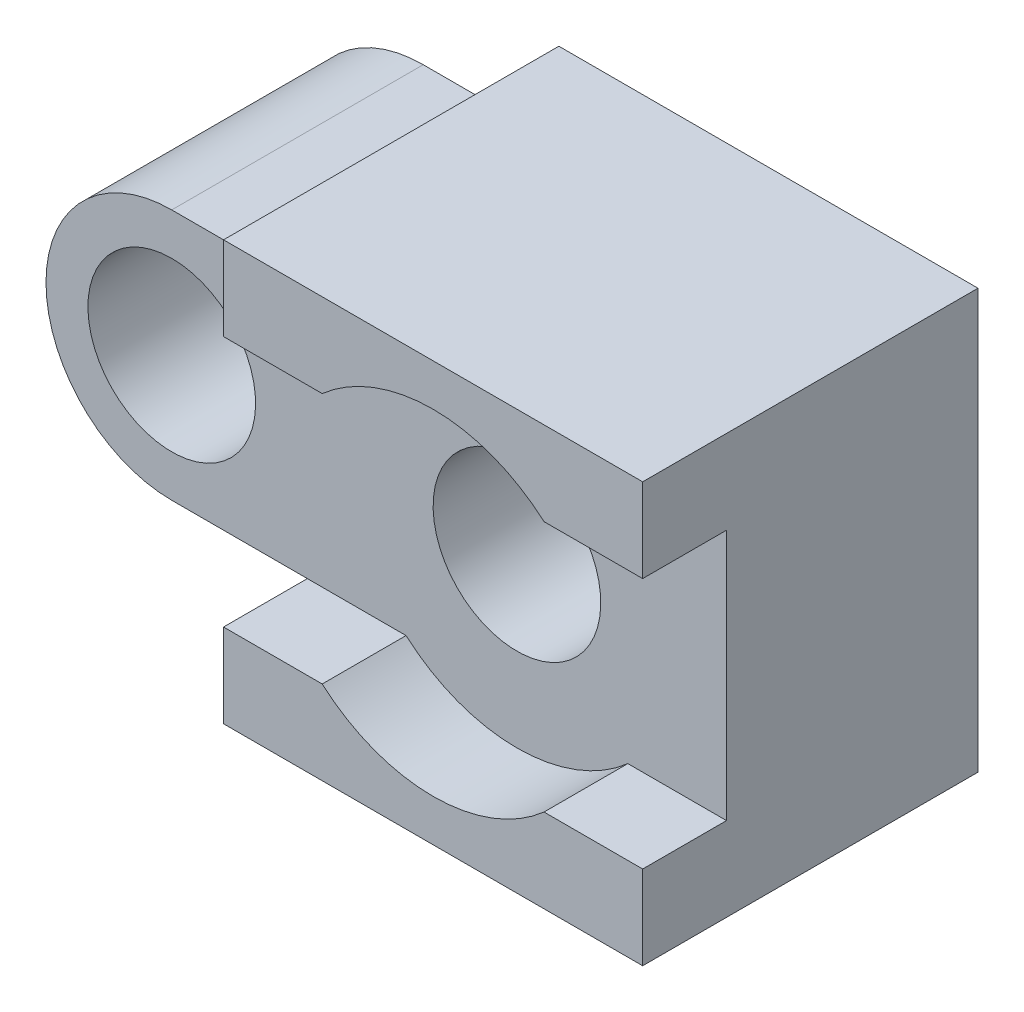
ISO-10303-21;
HEADER;
FILE_DESCRIPTION(('STEP AP214'),'2;1');
FILE_NAME('part.step','',(''),(''),'','','');
FILE_SCHEMA(('AUTOMOTIVE_DESIGN { 1 0 10303 214 1 1 1 1 }'));
ENDSEC;
DATA;
#1=APPLICATION_CONTEXT('core data for automotive mechanical design processes');
#2=APPLICATION_PROTOCOL_DEFINITION('international standard','automotive_design',2000,#1);
#3=PRODUCT_CONTEXT('',#1,'mechanical');
#4=PRODUCT('Part','Part','',(#3));
#5=PRODUCT_RELATED_PRODUCT_CATEGORY('part','',(#4));
#6=PRODUCT_DEFINITION_FORMATION('','',#4);
#7=PRODUCT_DEFINITION_CONTEXT('part definition',#1,'design');
#8=PRODUCT_DEFINITION('design','',#6,#7);
#9=PRODUCT_DEFINITION_SHAPE('','',#8);
#10=(LENGTH_UNIT() NAMED_UNIT(*) SI_UNIT(.MILLI.,.METRE.));
#11=(NAMED_UNIT(*) PLANE_ANGLE_UNIT() SI_UNIT($,.RADIAN.));
#12=(NAMED_UNIT(*) SI_UNIT($,.STERADIAN.) SOLID_ANGLE_UNIT());
#13=UNCERTAINTY_MEASURE_WITH_UNIT(LENGTH_MEASURE(1.E-05),#10,'distance_accuracy_value','');
#14=(GEOMETRIC_REPRESENTATION_CONTEXT(3) GLOBAL_UNCERTAINTY_ASSIGNED_CONTEXT((#13)) GLOBAL_UNIT_ASSIGNED_CONTEXT((#10,
#11,#12)) REPRESENTATION_CONTEXT('',''));
#15=CARTESIAN_POINT('',(0.,0.,0.));
#16=DIRECTION('',(0.,0.,1.));
#17=DIRECTION('',(1.,0.,0.));
#18=AXIS2_PLACEMENT_3D('',#15,#16,#17);
#19=CARTESIAN_POINT('',(-18.,3.,8.));
#20=DIRECTION('',(0.,1.,0.));
#21=DIRECTION('',(0.,0.,1.));
#22=AXIS2_PLACEMENT_3D('',#19,#20,#21);
#23=PLANE('',#22);
#24=DIRECTION('',(0.,0.,-1.));
#25=VECTOR('',#24,1.);
#26=CARTESIAN_POINT('',(2.64575131106459,3.,42.));
#27=LINE('',#26,#25);
#28=CARTESIAN_POINT('',(2.64575131106459,3.,6.));
#29=VERTEX_POINT('',#28);
#30=CARTESIAN_POINT('',(2.64575131106459,3.,8.));
#31=VERTEX_POINT('',#30);
#32=EDGE_CURVE('E141',#29,#31,#27,.F.);
#33=ORIENTED_EDGE('',*,*,#32,.F.);
#34=DIRECTION('',(1.,0.,0.));
#35=VECTOR('',#34,1.);
#36=CARTESIAN_POINT('',(-18.,3.,6.));
#37=LINE('',#36,#35);
#38=CARTESIAN_POINT('',(5.,3.,6.));
#39=VERTEX_POINT('',#38);
#40=EDGE_CURVE('E151',#29,#39,#37,.T.);
#41=ORIENTED_EDGE('',*,*,#40,.T.);
#42=DIRECTION('',(0.,0.,-1.));
#43=VECTOR('',#42,1.);
#44=CARTESIAN_POINT('',(5.,3.,8.));
#45=LINE('',#44,#43);
#46=CARTESIAN_POINT('',(5.,3.,8.));
#47=VERTEX_POINT('',#46);
#48=EDGE_CURVE('E208',#47,#39,#45,.T.);
#49=ORIENTED_EDGE('',*,*,#48,.F.);
#50=DIRECTION('',(1.,0.,0.));
#51=VECTOR('',#50,1.);
#52=CARTESIAN_POINT('',(-18.,3.,8.));
#53=LINE('',#52,#51);
#54=EDGE_CURVE('E153',#31,#47,#53,.T.);
#55=ORIENTED_EDGE('',*,*,#54,.F.);
#56=EDGE_LOOP('',(#33,#41,#49,#55));
#57=FACE_BOUND('',#56,.T.);
#58=ADVANCED_FACE('F33',(#57),#23,.F.);
#59=DIRECTION('',(0.,0.,-1.));
#60=VECTOR('',#59,1.);
#61=CARTESIAN_POINT('',(-2.64575131106459,3.,42.));
#62=LINE('',#61,#60);
#63=CARTESIAN_POINT('',(-2.64575131106459,3.,8.));
#64=VERTEX_POINT('',#63);
#65=CARTESIAN_POINT('',(-2.64575131106459,3.,6.));
#66=VERTEX_POINT('',#65);
#67=EDGE_CURVE('E144',#64,#66,#62,.T.);
#68=ORIENTED_EDGE('',*,*,#67,.F.);
#69=CARTESIAN_POINT('',(-5.,3.,8.));
#70=VERTEX_POINT('',#69);
#71=EDGE_CURVE('E174',#70,#64,#53,.T.);
#72=ORIENTED_EDGE('',*,*,#71,.F.);
#73=DIRECTION('',(0.,0.,-1.));
#74=VECTOR('',#73,1.);
#75=CARTESIAN_POINT('',(-5.,3.,8.));
#76=LINE('',#75,#74);
#77=CARTESIAN_POINT('',(-5.,3.,6.));
#78=VERTEX_POINT('',#77);
#79=EDGE_CURVE('E265',#70,#78,#76,.T.);
#80=ORIENTED_EDGE('',*,*,#79,.T.);
#81=EDGE_CURVE('E162',#78,#66,#37,.T.);
#82=ORIENTED_EDGE('',*,*,#81,.T.);
#83=EDGE_LOOP('',(#68,#72,#80,#82));
#84=FACE_BOUND('',#83,.T.);
#85=ADVANCED_FACE('F285',(#84),#23,.F.);
#86=CARTESIAN_POINT('',(-18.,-3.,8.));
#87=DIRECTION('',(0.,-1.,0.));
#88=DIRECTION('',(0.,0.,-1.));
#89=AXIS2_PLACEMENT_3D('',#86,#87,#88);
#90=PLANE('',#89);
#91=DIRECTION('',(0.,0.,-1.));
#92=VECTOR('',#91,1.);
#93=CARTESIAN_POINT('',(-2.64575131106459,-3.,42.));
#94=LINE('',#93,#92);
#95=CARTESIAN_POINT('',(-2.64575131106459,-3.,6.));
#96=VERTEX_POINT('',#95);
#97=CARTESIAN_POINT('',(-2.64575131106459,-3.,8.));
#98=VERTEX_POINT('',#97);
#99=EDGE_CURVE('E180',#96,#98,#94,.F.);
#100=ORIENTED_EDGE('',*,*,#99,.F.);
#101=DIRECTION('',(1.,0.,0.));
#102=VECTOR('',#101,1.);
#103=CARTESIAN_POINT('',(-18.,-3.,6.));
#104=LINE('',#103,#102);
#105=CARTESIAN_POINT('',(-5.,-3.,6.));
#106=VERTEX_POINT('',#105);
#107=EDGE_CURVE('E166',#106,#96,#104,.T.);
#108=ORIENTED_EDGE('',*,*,#107,.F.);
#109=DIRECTION('',(0.,0.,-1.));
#110=VECTOR('',#109,1.);
#111=CARTESIAN_POINT('',(-5.,-3.,8.));
#112=LINE('',#111,#110);
#113=CARTESIAN_POINT('',(-5.,-3.,8.));
#114=VERTEX_POINT('',#113);
#115=EDGE_CURVE('E257',#114,#106,#112,.T.);
#116=ORIENTED_EDGE('',*,*,#115,.F.);
#117=DIRECTION('',(1.,0.,0.));
#118=VECTOR('',#117,1.);
#119=CARTESIAN_POINT('',(-18.,-3.,8.));
#120=LINE('',#119,#118);
#121=EDGE_CURVE('E196',#114,#98,#120,.T.);
#122=ORIENTED_EDGE('',*,*,#121,.T.);
#123=EDGE_LOOP('',(#100,#108,#116,#122));
#124=FACE_BOUND('',#123,.T.);
#125=ADVANCED_FACE('F296',(#124),#90,.F.);
#126=DIRECTION('',(0.,0.,-1.));
#127=VECTOR('',#126,1.);
#128=CARTESIAN_POINT('',(2.64575131106459,-3.,42.));
#129=LINE('',#128,#127);
#130=CARTESIAN_POINT('',(2.64575131106459,-3.,8.));
#131=VERTEX_POINT('',#130);
#132=CARTESIAN_POINT('',(2.64575131106459,-3.,6.));
#133=VERTEX_POINT('',#132);
#134=EDGE_CURVE('E146',#131,#133,#129,.T.);
#135=ORIENTED_EDGE('',*,*,#134,.F.);
#136=CARTESIAN_POINT('',(5.,-3.,8.));
#137=VERTEX_POINT('',#136);
#138=EDGE_CURVE('E154',#131,#137,#120,.T.);
#139=ORIENTED_EDGE('',*,*,#138,.T.);
#140=DIRECTION('',(0.,0.,1.));
#141=VECTOR('',#140,1.);
#142=CARTESIAN_POINT('',(5.,-3.,8.));
#143=LINE('',#142,#141);
#144=CARTESIAN_POINT('',(5.,-3.,6.));
#145=VERTEX_POINT('',#144);
#146=EDGE_CURVE('E195',#145,#137,#143,.T.);
#147=ORIENTED_EDGE('',*,*,#146,.F.);
#148=EDGE_CURVE('E168',#133,#145,#104,.T.);
#149=ORIENTED_EDGE('',*,*,#148,.F.);
#150=EDGE_LOOP('',(#135,#139,#147,#149));
#151=FACE_BOUND('',#150,.T.);
#152=ADVANCED_FACE('F193',(#151),#90,.F.);
#153=CARTESIAN_POINT('',(-8.23564422329581,0.,8.));
#154=DIRECTION('',(0.,0.,1.));
#155=DIRECTION('',(1.,0.,0.));
#156=AXIS2_PLACEMENT_3D('',#153,#154,#155);
#157=PLANE('',#156);
#158=ORIENTED_EDGE('',*,*,#71,.T.);
#159=CARTESIAN_POINT('',(0.,0.,8.));
#160=DIRECTION('',(0.,0.,1.));
#161=DIRECTION('',(1.,0.,0.));
#162=AXIS2_PLACEMENT_3D('',#159,#160,#161);
#163=CIRCLE('',#162,4.);
#164=EDGE_CURVE('E155',#64,#31,#163,.F.);
#165=ORIENTED_EDGE('',*,*,#164,.T.);
#166=ORIENTED_EDGE('',*,*,#54,.T.);
#167=DIRECTION('',(0.,1.,0.));
#168=VECTOR('',#167,1.);
#169=CARTESIAN_POINT('',(5.,-5.,8.));
#170=LINE('',#169,#168);
#171=CARTESIAN_POINT('',(5.,5.,8.));
#172=VERTEX_POINT('',#171);
#173=EDGE_CURVE('E221',#47,#172,#170,.T.);
#174=ORIENTED_EDGE('',*,*,#173,.T.);
#175=DIRECTION('',(-1.,0.,0.));
#176=VECTOR('',#175,1.);
#177=CARTESIAN_POINT('',(-5.,5.,8.));
#178=LINE('',#177,#176);
#179=CARTESIAN_POINT('',(-5.,5.,8.));
#180=VERTEX_POINT('',#179);
#181=EDGE_CURVE('E220',#172,#180,#178,.T.);
#182=ORIENTED_EDGE('',*,*,#181,.T.);
#183=DIRECTION('',(0.,-1.,0.));
#184=VECTOR('',#183,1.);
#185=CARTESIAN_POINT('',(-5.,3.,8.));
#186=LINE('',#185,#184);
#187=EDGE_CURVE('E223',#180,#70,#186,.T.);
#188=ORIENTED_EDGE('',*,*,#187,.T.);
#189=EDGE_LOOP('',(#158,#165,#166,#174,#182,#188));
#190=FACE_BOUND('',#189,.T.);
#191=ADVANCED_FACE('F305',(#190),#157,.T.);
#192=ORIENTED_EDGE('',*,*,#138,.F.);
#193=CARTESIAN_POINT('',(0.,0.,8.));
#194=DIRECTION('',(0.,0.,1.));
#195=DIRECTION('',(1.,0.,0.));
#196=AXIS2_PLACEMENT_3D('',#193,#194,#195);
#197=CIRCLE('',#196,4.);
#198=EDGE_CURVE('E182',#131,#98,#197,.F.);
#199=ORIENTED_EDGE('',*,*,#198,.T.);
#200=ORIENTED_EDGE('',*,*,#121,.F.);
#201=DIRECTION('',(0.,-1.,0.));
#202=VECTOR('',#201,1.);
#203=CARTESIAN_POINT('',(-5.,-5.,8.));
#204=LINE('',#203,#202);
#205=CARTESIAN_POINT('',(-5.,-5.,8.));
#206=VERTEX_POINT('',#205);
#207=EDGE_CURVE('E226',#114,#206,#204,.T.);
#208=ORIENTED_EDGE('',*,*,#207,.T.);
#209=DIRECTION('',(1.,0.,0.));
#210=VECTOR('',#209,1.);
#211=CARTESIAN_POINT('',(-5.,-5.,8.));
#212=LINE('',#211,#210);
#213=CARTESIAN_POINT('',(5.,-5.,8.));
#214=VERTEX_POINT('',#213);
#215=EDGE_CURVE('E228',#206,#214,#212,.T.);
#216=ORIENTED_EDGE('',*,*,#215,.T.);
#217=EDGE_CURVE('E217',#214,#137,#170,.T.);
#218=ORIENTED_EDGE('',*,*,#217,.T.);
#219=EDGE_LOOP('',(#192,#199,#200,#208,#216,#218));
#220=FACE_BOUND('',#219,.T.);
#221=ADVANCED_FACE('F299',(#220),#157,.T.);
#222=CARTESIAN_POINT('',(-8.23564422329581,0.,0.));
#223=DIRECTION('',(0.,0.,1.));
#224=DIRECTION('',(1.,0.,0.));
#225=AXIS2_PLACEMENT_3D('',#222,#223,#224);
#226=PLANE('',#225);
#227=DIRECTION('',(0.,1.,0.));
#228=VECTOR('',#227,1.);
#229=CARTESIAN_POINT('',(5.,-5.,0.));
#230=LINE('',#229,#228);
#231=CARTESIAN_POINT('',(5.,-5.,0.));
#232=VERTEX_POINT('',#231);
#233=CARTESIAN_POINT('',(5.,5.,0.));
#234=VERTEX_POINT('',#233);
#235=EDGE_CURVE('E216',#232,#234,#230,.T.);
#236=ORIENTED_EDGE('',*,*,#235,.F.);
#237=DIRECTION('',(1.,0.,0.));
#238=VECTOR('',#237,1.);
#239=CARTESIAN_POINT('',(-5.,-5.,0.));
#240=LINE('',#239,#238);
#241=CARTESIAN_POINT('',(-5.,-5.,0.));
#242=VERTEX_POINT('',#241);
#243=EDGE_CURVE('E249',#242,#232,#240,.T.);
#244=ORIENTED_EDGE('',*,*,#243,.F.);
#245=DIRECTION('',(0.,-1.,0.));
#246=VECTOR('',#245,1.);
#247=CARTESIAN_POINT('',(-5.,-5.,0.));
#248=LINE('',#247,#246);
#249=CARTESIAN_POINT('',(-5.,-3.,0.));
#250=VERTEX_POINT('',#249);
#251=EDGE_CURVE('E247',#250,#242,#248,.T.);
#252=ORIENTED_EDGE('',*,*,#251,.F.);
#253=DIRECTION('',(1.,0.,0.));
#254=VECTOR('',#253,1.);
#255=CARTESIAN_POINT('',(-5.,-3.,0.));
#256=LINE('',#255,#254);
#257=CARTESIAN_POINT('',(-8.23564422329581,-3.,0.));
#258=VERTEX_POINT('',#257);
#259=EDGE_CURVE('E244',#258,#250,#256,.T.);
#260=ORIENTED_EDGE('',*,*,#259,.F.);
#261=CARTESIAN_POINT('',(-8.23564422329581,0.,0.));
#262=DIRECTION('',(0.,0.,1.));
#263=DIRECTION('',(-1.,0.,0.));
#264=AXIS2_PLACEMENT_3D('',#261,#262,#263);
#265=CIRCLE('',#264,3.);
#266=CARTESIAN_POINT('',(-8.23564422329581,3.,0.));
#267=VERTEX_POINT('',#266);
#268=EDGE_CURVE('E241',#267,#258,#265,.T.);
#269=ORIENTED_EDGE('',*,*,#268,.F.);
#270=DIRECTION('',(-1.,0.,0.));
#271=VECTOR('',#270,1.);
#272=CARTESIAN_POINT('',(-5.,3.,0.));
#273=LINE('',#272,#271);
#274=CARTESIAN_POINT('',(-5.,3.,0.));
#275=VERTEX_POINT('',#274);
#276=EDGE_CURVE('E238',#275,#267,#273,.T.);
#277=ORIENTED_EDGE('',*,*,#276,.F.);
#278=DIRECTION('',(0.,-1.,0.));
#279=VECTOR('',#278,1.);
#280=CARTESIAN_POINT('',(-5.,3.,0.));
#281=LINE('',#280,#279);
#282=CARTESIAN_POINT('',(-5.,5.,0.));
#283=VERTEX_POINT('',#282);
#284=EDGE_CURVE('E235',#283,#275,#281,.T.);
#285=ORIENTED_EDGE('',*,*,#284,.F.);
#286=DIRECTION('',(-1.,0.,0.));
#287=VECTOR('',#286,1.);
#288=CARTESIAN_POINT('',(-5.,5.,0.));
#289=LINE('',#288,#287);
#290=EDGE_CURVE('E233',#234,#283,#289,.T.);
#291=ORIENTED_EDGE('',*,*,#290,.F.);
#292=EDGE_LOOP('',(#236,#244,#252,#260,#269,#277,#285,#291));
#293=FACE_BOUND('',#292,.T.);
#294=CARTESIAN_POINT('',(-8.23564422329581,0.,0.));
#295=DIRECTION('',(0.,0.,1.));
#296=DIRECTION('',(1.,0.,0.));
#297=AXIS2_PLACEMENT_3D('',#294,#295,#296);
#298=CIRCLE('',#297,2.);
#299=CARTESIAN_POINT('',(-6.23564422329581,0.,0.));
#300=VERTEX_POINT('',#299);
#301=EDGE_CURVE('E213',#300,#300,#298,.T.);
#302=ORIENTED_EDGE('',*,*,#301,.T.);
#303=EDGE_LOOP('',(#302));
#304=FACE_BOUND('',#303,.T.);
#305=CARTESIAN_POINT('',(0.,0.,0.));
#306=DIRECTION('',(0.,0.,1.));
#307=DIRECTION('',(1.,0.,0.));
#308=AXIS2_PLACEMENT_3D('',#305,#306,#307);
#309=CIRCLE('',#308,2.);
#310=CARTESIAN_POINT('',(2.,0.,0.));
#311=VERTEX_POINT('',#310);
#312=EDGE_CURVE('E210',#311,#311,#309,.T.);
#313=ORIENTED_EDGE('',*,*,#312,.T.);
#314=EDGE_LOOP('',(#313));
#315=FACE_BOUND('',#314,.T.);
#316=ADVANCED_FACE('F279',(#293,#304,#315),#226,.F.);
#317=CARTESIAN_POINT('',(5.,-5.,8.));
#318=DIRECTION('',(-1.,0.,0.));
#319=DIRECTION('',(0.,0.,1.));
#320=AXIS2_PLACEMENT_3D('',#317,#318,#319);
#321=PLANE('',#320);
#322=ORIENTED_EDGE('',*,*,#173,.F.);
#323=ORIENTED_EDGE('',*,*,#48,.T.);
#324=DIRECTION('',(0.,-1.,0.));
#325=VECTOR('',#324,1.);
#326=CARTESIAN_POINT('',(5.,-5.,6.));
#327=LINE('',#326,#325);
#328=EDGE_CURVE('E160',#39,#145,#327,.T.);
#329=ORIENTED_EDGE('',*,*,#328,.T.);
#330=ORIENTED_EDGE('',*,*,#146,.T.);
#331=ORIENTED_EDGE('',*,*,#217,.F.);
#332=DIRECTION('',(0.,0.,-1.));
#333=VECTOR('',#332,1.);
#334=CARTESIAN_POINT('',(5.,-5.,8.));
#335=LINE('',#334,#333);
#336=EDGE_CURVE('E230',#214,#232,#335,.T.);
#337=ORIENTED_EDGE('',*,*,#336,.T.);
#338=ORIENTED_EDGE('',*,*,#235,.T.);
#339=DIRECTION('',(0.,0.,-1.));
#340=VECTOR('',#339,1.);
#341=CARTESIAN_POINT('',(5.,5.,8.));
#342=LINE('',#341,#340);
#343=EDGE_CURVE('E11',#172,#234,#342,.T.);
#344=ORIENTED_EDGE('',*,*,#343,.F.);
#345=EDGE_LOOP('',(#322,#323,#329,#330,#331,#337,#338,#344));
#346=FACE_BOUND('',#345,.T.);
#347=ADVANCED_FACE('F35',(#346),#321,.F.);
#348=CARTESIAN_POINT('',(-5.,5.,8.));
#349=DIRECTION('',(0.,-1.,0.));
#350=DIRECTION('',(0.,0.,-1.));
#351=AXIS2_PLACEMENT_3D('',#348,#349,#350);
#352=PLANE('',#351);
#353=ORIENTED_EDGE('',*,*,#290,.T.);
#354=DIRECTION('',(0.,0.,-1.));
#355=VECTOR('',#354,1.);
#356=CARTESIAN_POINT('',(-5.,5.,8.));
#357=LINE('',#356,#355);
#358=EDGE_CURVE('E42',#180,#283,#357,.T.);
#359=ORIENTED_EDGE('',*,*,#358,.F.);
#360=ORIENTED_EDGE('',*,*,#181,.F.);
#361=ORIENTED_EDGE('',*,*,#343,.T.);
#362=EDGE_LOOP('',(#353,#359,#360,#361));
#363=FACE_BOUND('',#362,.T.);
#364=ADVANCED_FACE('F306',(#363),#352,.F.);
#365=CARTESIAN_POINT('',(-5.,3.,8.));
#366=DIRECTION('',(1.,0.,0.));
#367=DIRECTION('',(0.,0.,-1.));
#368=AXIS2_PLACEMENT_3D('',#365,#366,#367);
#369=PLANE('',#368);
#370=ORIENTED_EDGE('',*,*,#284,.T.);
#371=EDGE_CURVE('E264',#78,#275,#76,.T.);
#372=ORIENTED_EDGE('',*,*,#371,.F.);
#373=ORIENTED_EDGE('',*,*,#79,.F.);
#374=ORIENTED_EDGE('',*,*,#187,.F.);
#375=ORIENTED_EDGE('',*,*,#358,.T.);
#376=EDGE_LOOP('',(#370,#372,#373,#374,#375));
#377=FACE_BOUND('',#376,.T.);
#378=ADVANCED_FACE('F272',(#377),#369,.F.);
#379=CARTESIAN_POINT('',(-5.,3.,8.));
#380=DIRECTION('',(0.,-1.,0.));
#381=DIRECTION('',(1.,0.,0.));
#382=AXIS2_PLACEMENT_3D('',#379,#380,#381);
#383=PLANE('',#382);
#384=DIRECTION('',(0.,0.,-1.));
#385=VECTOR('',#384,1.);
#386=CARTESIAN_POINT('',(-8.23564422329581,3.,8.));
#387=LINE('',#386,#385);
#388=CARTESIAN_POINT('',(-8.23564422329581,3.,6.));
#389=VERTEX_POINT('',#388);
#390=EDGE_CURVE('E262',#389,#267,#387,.T.);
#391=ORIENTED_EDGE('',*,*,#390,.F.);
#392=EDGE_CURVE('E165',#389,#78,#37,.T.);
#393=ORIENTED_EDGE('',*,*,#392,.T.);
#394=ORIENTED_EDGE('',*,*,#371,.T.);
#395=ORIENTED_EDGE('',*,*,#276,.T.);
#396=EDGE_LOOP('',(#391,#393,#394,#395));
#397=FACE_BOUND('',#396,.T.);
#398=ADVANCED_FACE('F283',(#397),#383,.F.);
#399=CARTESIAN_POINT('',(-8.23564422329581,0.,8.));
#400=DIRECTION('',(0.,0.,-1.));
#401=DIRECTION('',(-1.,0.,0.));
#402=AXIS2_PLACEMENT_3D('',#399,#400,#401);
#403=CYLINDRICAL_SURFACE('',#402,3.);
#404=DIRECTION('',(0.,0.,-1.));
#405=VECTOR('',#404,1.);
#406=CARTESIAN_POINT('',(-8.23564422329581,-3.,8.));
#407=LINE('',#406,#405);
#408=CARTESIAN_POINT('',(-8.23564422329581,-3.,6.));
#409=VERTEX_POINT('',#408);
#410=EDGE_CURVE('E260',#409,#258,#407,.T.);
#411=ORIENTED_EDGE('',*,*,#410,.F.);
#412=CARTESIAN_POINT('',(-8.23564422329581,0.,6.));
#413=DIRECTION('',(0.,0.,-1.));
#414=DIRECTION('',(0.,1.,0.));
#415=AXIS2_PLACEMENT_3D('',#412,#413,#414);
#416=CIRCLE('',#415,3.);
#417=EDGE_CURVE('E203',#409,#389,#416,.T.);
#418=ORIENTED_EDGE('',*,*,#417,.T.);
#419=ORIENTED_EDGE('',*,*,#390,.T.);
#420=ORIENTED_EDGE('',*,*,#268,.T.);
#421=EDGE_LOOP('',(#411,#418,#419,#420));
#422=FACE_BOUND('',#421,.T.);
#423=ADVANCED_FACE('F289',(#422),#403,.T.);
#424=CARTESIAN_POINT('',(-5.,-3.,8.));
#425=DIRECTION('',(0.,1.,0.));
#426=DIRECTION('',(-1.,0.,0.));
#427=AXIS2_PLACEMENT_3D('',#424,#425,#426);
#428=PLANE('',#427);
#429=EDGE_CURVE('E256',#106,#250,#112,.T.);
#430=ORIENTED_EDGE('',*,*,#429,.F.);
#431=EDGE_CURVE('E163',#409,#106,#104,.T.);
#432=ORIENTED_EDGE('',*,*,#431,.F.);
#433=ORIENTED_EDGE('',*,*,#410,.T.);
#434=ORIENTED_EDGE('',*,*,#259,.T.);
#435=EDGE_LOOP('',(#430,#432,#433,#434));
#436=FACE_BOUND('',#435,.T.);
#437=ADVANCED_FACE('F292',(#436),#428,.F.);
#438=CARTESIAN_POINT('',(-5.,-5.,8.));
#439=DIRECTION('',(1.,0.,0.));
#440=DIRECTION('',(0.,0.,-1.));
#441=AXIS2_PLACEMENT_3D('',#438,#439,#440);
#442=PLANE('',#441);
#443=ORIENTED_EDGE('',*,*,#251,.T.);
#444=DIRECTION('',(0.,0.,-1.));
#445=VECTOR('',#444,1.);
#446=CARTESIAN_POINT('',(-5.,-5.,8.));
#447=LINE('',#446,#445);
#448=EDGE_CURVE('E253',#206,#242,#447,.T.);
#449=ORIENTED_EDGE('',*,*,#448,.F.);
#450=ORIENTED_EDGE('',*,*,#207,.F.);
#451=ORIENTED_EDGE('',*,*,#115,.T.);
#452=ORIENTED_EDGE('',*,*,#429,.T.);
#453=EDGE_LOOP('',(#443,#449,#450,#451,#452));
#454=FACE_BOUND('',#453,.T.);
#455=ADVANCED_FACE('F314',(#454),#442,.F.);
#456=CARTESIAN_POINT('',(-5.,-5.,8.));
#457=DIRECTION('',(0.,1.,0.));
#458=DIRECTION('',(0.,0.,1.));
#459=AXIS2_PLACEMENT_3D('',#456,#457,#458);
#460=PLANE('',#459);
#461=ORIENTED_EDGE('',*,*,#243,.T.);
#462=ORIENTED_EDGE('',*,*,#336,.F.);
#463=ORIENTED_EDGE('',*,*,#215,.F.);
#464=ORIENTED_EDGE('',*,*,#448,.T.);
#465=EDGE_LOOP('',(#461,#462,#463,#464));
#466=FACE_BOUND('',#465,.T.);
#467=ADVANCED_FACE('F310',(#466),#460,.F.);
#468=CARTESIAN_POINT('',(-8.23564422329581,0.,8.));
#469=DIRECTION('',(0.,0.,-1.));
#470=DIRECTION('',(-1.,0.,0.));
#471=AXIS2_PLACEMENT_3D('',#468,#469,#470);
#472=CYLINDRICAL_SURFACE('',#471,2.);
#473=CARTESIAN_POINT('',(-8.23564422329581,0.,6.));
#474=DIRECTION('',(0.,0.,-1.));
#475=DIRECTION('',(0.,1.,0.));
#476=AXIS2_PLACEMENT_3D('',#473,#474,#475);
#477=CIRCLE('',#476,2.);
#478=CARTESIAN_POINT('',(-8.23564422329581,2.,6.));
#479=VERTEX_POINT('',#478);
#480=EDGE_CURVE('E200',#479,#479,#477,.T.);
#481=ORIENTED_EDGE('',*,*,#480,.F.);
#482=EDGE_LOOP('',(#481));
#483=FACE_BOUND('',#482,.T.);
#484=ORIENTED_EDGE('',*,*,#301,.F.);
#485=EDGE_LOOP('',(#484));
#486=FACE_BOUND('',#485,.T.);
#487=ADVANCED_FACE('F321',(#483,#486),#472,.F.);
#488=CARTESIAN_POINT('',(0.,0.,8.));
#489=DIRECTION('',(0.,0.,-1.));
#490=DIRECTION('',(-1.,0.,0.));
#491=AXIS2_PLACEMENT_3D('',#488,#489,#490);
#492=CYLINDRICAL_SURFACE('',#491,2.);
#493=CARTESIAN_POINT('',(0.,0.,6.));
#494=DIRECTION('',(0.,0.,-1.));
#495=DIRECTION('',(0.,1.,0.));
#496=AXIS2_PLACEMENT_3D('',#493,#494,#495);
#497=CIRCLE('',#496,2.);
#498=CARTESIAN_POINT('',(0.,2.,6.));
#499=VERTEX_POINT('',#498);
#500=EDGE_CURVE('E37',#499,#499,#497,.T.);
#501=ORIENTED_EDGE('',*,*,#500,.F.);
#502=EDGE_LOOP('',(#501));
#503=FACE_BOUND('',#502,.T.);
#504=ORIENTED_EDGE('',*,*,#312,.F.);
#505=EDGE_LOOP('',(#504));
#506=FACE_BOUND('',#505,.T.);
#507=ADVANCED_FACE('F333',(#503,#506),#492,.F.);
#508=CARTESIAN_POINT('',(-18.,3.,6.));
#509=DIRECTION('',(0.,0.,-1.));
#510=DIRECTION('',(0.,1.,0.));
#511=AXIS2_PLACEMENT_3D('',#508,#509,#510);
#512=PLANE('',#511);
#513=ORIENTED_EDGE('',*,*,#40,.F.);
#514=CARTESIAN_POINT('',(0.,0.,6.));
#515=DIRECTION('',(0.,0.,1.));
#516=DIRECTION('',(1.,0.,0.));
#517=AXIS2_PLACEMENT_3D('',#514,#515,#516);
#518=CIRCLE('',#517,4.);
#519=EDGE_CURVE('E56',#29,#66,#518,.T.);
#520=ORIENTED_EDGE('',*,*,#519,.T.);
#521=ORIENTED_EDGE('',*,*,#81,.F.);
#522=ORIENTED_EDGE('',*,*,#392,.F.);
#523=ORIENTED_EDGE('',*,*,#417,.F.);
#524=ORIENTED_EDGE('',*,*,#431,.T.);
#525=ORIENTED_EDGE('',*,*,#107,.T.);
#526=EDGE_CURVE('E49',#96,#133,#518,.T.);
#527=ORIENTED_EDGE('',*,*,#526,.T.);
#528=ORIENTED_EDGE('',*,*,#148,.T.);
#529=ORIENTED_EDGE('',*,*,#328,.F.);
#530=EDGE_LOOP('',(#513,#520,#521,#522,#523,#524,#525,#527,#528,#529));
#531=FACE_BOUND('',#530,.T.);
#532=ORIENTED_EDGE('',*,*,#500,.T.);
#533=EDGE_LOOP('',(#532));
#534=FACE_BOUND('',#533,.T.);
#535=ORIENTED_EDGE('',*,*,#480,.T.);
#536=EDGE_LOOP('',(#535));
#537=FACE_BOUND('',#536,.T.);
#538=ADVANCED_FACE('F157',(#531,#534,#537),#512,.F.);
#539=CARTESIAN_POINT('',(0.,0.,42.));
#540=DIRECTION('',(0.,0.,-1.));
#541=DIRECTION('',(-1.,0.,0.));
#542=AXIS2_PLACEMENT_3D('',#539,#540,#541);
#543=CYLINDRICAL_SURFACE('',#542,4.);
#544=ORIENTED_EDGE('',*,*,#99,.T.);
#545=ORIENTED_EDGE('',*,*,#198,.F.);
#546=ORIENTED_EDGE('',*,*,#134,.T.);
#547=ORIENTED_EDGE('',*,*,#526,.F.);
#548=EDGE_LOOP('',(#544,#545,#546,#547));
#549=FACE_BOUND('',#548,.T.);
#550=ADVANCED_FACE('F188',(#549),#543,.F.);
#551=ORIENTED_EDGE('',*,*,#32,.T.);
#552=ORIENTED_EDGE('',*,*,#164,.F.);
#553=ORIENTED_EDGE('',*,*,#67,.T.);
#554=ORIENTED_EDGE('',*,*,#519,.F.);
#555=EDGE_LOOP('',(#551,#552,#553,#554));
#556=FACE_BOUND('',#555,.T.);
#557=ADVANCED_FACE('F140',(#556),#543,.F.);
#558=CLOSED_SHELL('',(#58,#85,#125,#152,#191,#221,#316,#347,#364,#378,#398,#423,#437,#455,#467,
#487,#507,#538,#550,#557));
#559=MANIFOLD_SOLID_BREP('B2',#558);
#560=ADVANCED_BREP_SHAPE_REPRESENTATION('',(#18,#559),#14);
#561=SHAPE_DEFINITION_REPRESENTATION(#9,#560);
ENDSEC;
END-ISO-10303-21;
